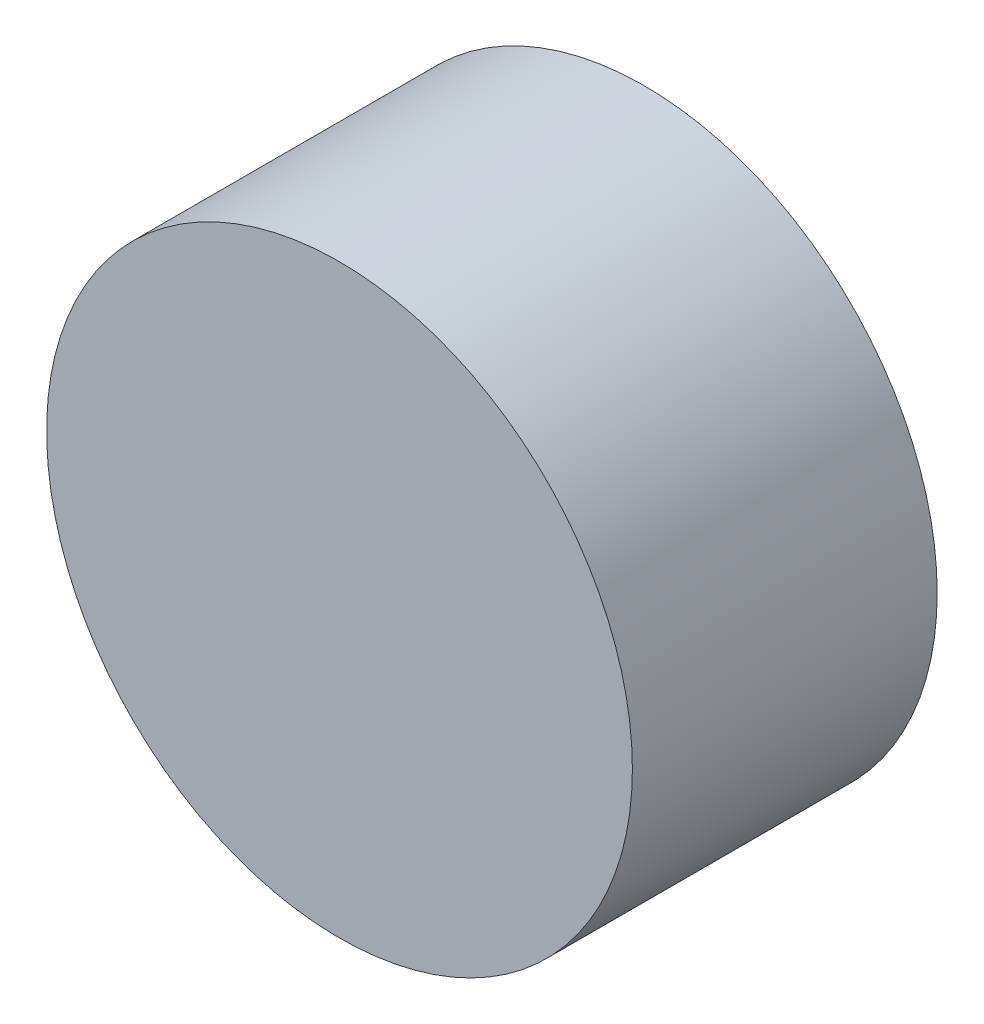
ISO-10303-21;
HEADER;
FILE_DESCRIPTION(('STEP AP214'),'2;1');
FILE_NAME('part.step','',(''),(''),'','','');
FILE_SCHEMA(('AUTOMOTIVE_DESIGN { 1 0 10303 214 1 1 1 1 }'));
ENDSEC;
DATA;
#1=APPLICATION_CONTEXT('core data for automotive mechanical design processes');
#2=APPLICATION_PROTOCOL_DEFINITION('international standard','automotive_design',2000,#1);
#3=PRODUCT_CONTEXT('',#1,'mechanical');
#4=PRODUCT('Part','Part','',(#3));
#5=PRODUCT_RELATED_PRODUCT_CATEGORY('part','',(#4));
#6=PRODUCT_DEFINITION_FORMATION('','',#4);
#7=PRODUCT_DEFINITION_CONTEXT('part definition',#1,'design');
#8=PRODUCT_DEFINITION('design','',#6,#7);
#9=PRODUCT_DEFINITION_SHAPE('','',#8);
#10=(LENGTH_UNIT() NAMED_UNIT(*) SI_UNIT(.MILLI.,.METRE.));
#11=(NAMED_UNIT(*) PLANE_ANGLE_UNIT() SI_UNIT($,.RADIAN.));
#12=(NAMED_UNIT(*) SI_UNIT($,.STERADIAN.) SOLID_ANGLE_UNIT());
#13=UNCERTAINTY_MEASURE_WITH_UNIT(LENGTH_MEASURE(1.E-05),#10,'distance_accuracy_value','');
#14=(GEOMETRIC_REPRESENTATION_CONTEXT(3) GLOBAL_UNCERTAINTY_ASSIGNED_CONTEXT((#13)) GLOBAL_UNIT_ASSIGNED_CONTEXT((#10,
#11,#12)) REPRESENTATION_CONTEXT('',''));
#15=CARTESIAN_POINT('',(0.,0.,0.));
#16=DIRECTION('',(0.,0.,1.));
#17=DIRECTION('',(1.,0.,0.));
#18=AXIS2_PLACEMENT_3D('',#15,#16,#17);
#19=CARTESIAN_POINT('',(0.,-24.5,913.97505065));
#20=DIRECTION('',(0.,0.,1.));
#21=DIRECTION('',(0.,-1.,0.));
#22=AXIS2_PLACEMENT_3D('',#19,#20,#21);
#23=PLANE('',#22);
#24=CARTESIAN_POINT('',(0.,-24.5,913.97505065));
#25=DIRECTION('',(0.,0.,1.));
#26=DIRECTION('',(-1.,0.,0.));
#27=AXIS2_PLACEMENT_3D('',#24,#25,#26);
#28=CIRCLE('',#27,30.75);
#29=CARTESIAN_POINT('',(30.75,-24.5,913.97505065));
#30=VERTEX_POINT('',#29);
#31=EDGE_CURVE('E11',#30,#30,#28,.T.);
#32=ORIENTED_EDGE('',*,*,#31,.F.);
#33=EDGE_LOOP('',(#32));
#34=FACE_BOUND('',#33,.T.);
#35=ADVANCED_FACE('F17',(#34),#23,.F.);
#36=CARTESIAN_POINT('',(0.,-24.5,945.97505065));
#37=DIRECTION('',(0.,0.,1.));
#38=DIRECTION('',(0.,-1.,0.));
#39=AXIS2_PLACEMENT_3D('',#36,#37,#38);
#40=PLANE('',#39);
#41=CARTESIAN_POINT('',(0.,-24.5,945.97505065));
#42=DIRECTION('',(0.,0.,1.));
#43=DIRECTION('',(-1.,0.,0.));
#44=AXIS2_PLACEMENT_3D('',#41,#42,#43);
#45=CIRCLE('',#44,30.75);
#46=CARTESIAN_POINT('',(30.75,-24.5,945.97505065));
#47=VERTEX_POINT('',#46);
#48=EDGE_CURVE('E26',#47,#47,#45,.T.);
#49=ORIENTED_EDGE('',*,*,#48,.T.);
#50=EDGE_LOOP('',(#49));
#51=FACE_BOUND('',#50,.T.);
#52=ADVANCED_FACE('F19',(#51),#40,.T.);
#53=CARTESIAN_POINT('',(0.,-24.5,945.97505065));
#54=DIRECTION('',(0.,0.,-1.));
#55=DIRECTION('',(1.,0.,0.));
#56=AXIS2_PLACEMENT_3D('',#53,#54,#55);
#57=CYLINDRICAL_SURFACE('',#56,30.75);
#58=ORIENTED_EDGE('',*,*,#31,.T.);
#59=EDGE_LOOP('',(#58));
#60=FACE_BOUND('',#59,.T.);
#61=ORIENTED_EDGE('',*,*,#48,.F.);
#62=EDGE_LOOP('',(#61));
#63=FACE_BOUND('',#62,.T.);
#64=ADVANCED_FACE('F55',(#60,#63),#57,.T.);
#65=CLOSED_SHELL('',(#35,#52,#64));
#66=MANIFOLD_SOLID_BREP('B1',#65);
#67=ADVANCED_BREP_SHAPE_REPRESENTATION('',(#18,#66),#14);
#68=SHAPE_DEFINITION_REPRESENTATION(#9,#67);
ENDSEC;
END-ISO-10303-21;
